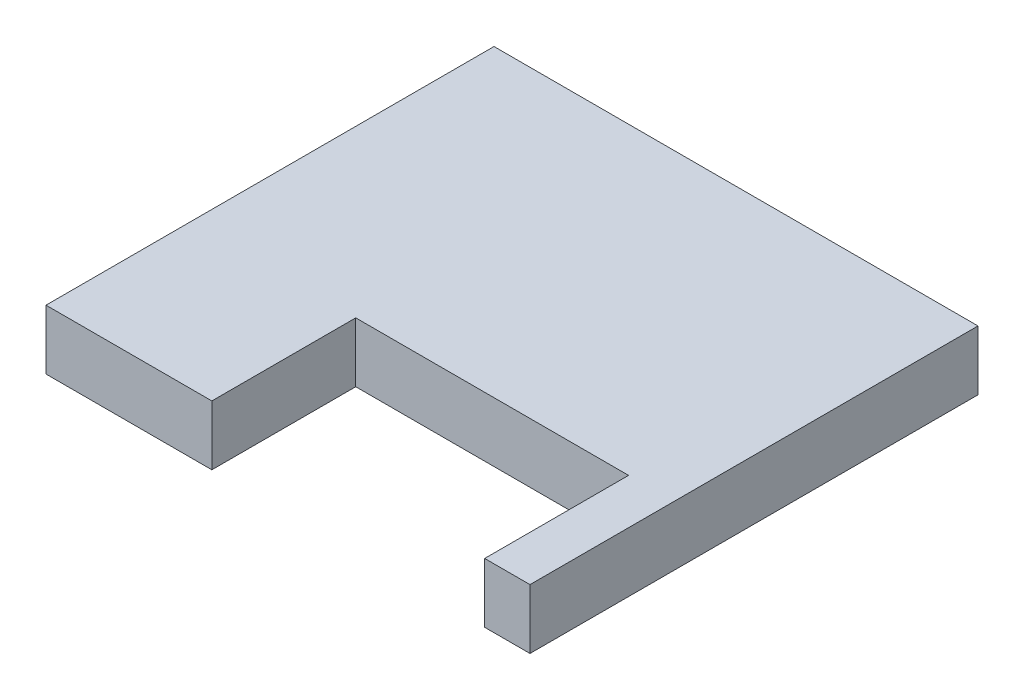
ISO-10303-21;
HEADER;
FILE_DESCRIPTION(('STEP AP214'),'2;1');
FILE_NAME('part.step','',(''),(''),'','','');
FILE_SCHEMA(('AUTOMOTIVE_DESIGN { 1 0 10303 214 1 1 1 1 }'));
ENDSEC;
DATA;
#1=APPLICATION_CONTEXT('core data for automotive mechanical design processes');
#2=APPLICATION_PROTOCOL_DEFINITION('international standard','automotive_design',2000,#1);
#3=PRODUCT_CONTEXT('',#1,'mechanical');
#4=PRODUCT('Part','Part','',(#3));
#5=PRODUCT_RELATED_PRODUCT_CATEGORY('part','',(#4));
#6=PRODUCT_DEFINITION_FORMATION('','',#4);
#7=PRODUCT_DEFINITION_CONTEXT('part definition',#1,'design');
#8=PRODUCT_DEFINITION('design','',#6,#7);
#9=PRODUCT_DEFINITION_SHAPE('','',#8);
#10=(LENGTH_UNIT() NAMED_UNIT(*) SI_UNIT(.MILLI.,.METRE.));
#11=(NAMED_UNIT(*) PLANE_ANGLE_UNIT() SI_UNIT($,.RADIAN.));
#12=(NAMED_UNIT(*) SI_UNIT($,.STERADIAN.) SOLID_ANGLE_UNIT());
#13=UNCERTAINTY_MEASURE_WITH_UNIT(LENGTH_MEASURE(1.E-05),#10,'distance_accuracy_value','');
#14=(GEOMETRIC_REPRESENTATION_CONTEXT(3) GLOBAL_UNCERTAINTY_ASSIGNED_CONTEXT((#13)) GLOBAL_UNIT_ASSIGNED_CONTEXT((#10,
#11,#12)) REPRESENTATION_CONTEXT('',''));
#15=CARTESIAN_POINT('',(0.,0.,0.));
#16=DIRECTION('',(0.,0.,1.));
#17=DIRECTION('',(1.,0.,0.));
#18=AXIS2_PLACEMENT_3D('',#15,#16,#17);
#19=CARTESIAN_POINT('',(110.307151448188,13.59916,-102.108));
#20=DIRECTION('',(0.,0.,1.));
#21=DIRECTION('',(1.,0.,0.));
#22=AXIS2_PLACEMENT_3D('',#19,#20,#21);
#23=PLANE('',#22);
#24=DIRECTION('',(-1.,0.,0.));
#25=VECTOR('',#24,1.);
#26=CARTESIAN_POINT('',(110.307151448188,0.,-102.108));
#27=LINE('',#26,#25);
#28=CARTESIAN_POINT('',(110.307151448188,0.,-102.108));
#29=VERTEX_POINT('',#28);
#30=CARTESIAN_POINT('',(0.,0.,-102.108));
#31=VERTEX_POINT('',#30);
#32=EDGE_CURVE('E129',#29,#31,#27,.T.);
#33=ORIENTED_EDGE('',*,*,#32,.T.);
#34=DIRECTION('',(0.,-1.,0.));
#35=VECTOR('',#34,1.);
#36=CARTESIAN_POINT('',(0.,13.59916,-102.108));
#37=LINE('',#36,#35);
#38=CARTESIAN_POINT('',(0.,13.59916,-102.108));
#39=VERTEX_POINT('',#38);
#40=EDGE_CURVE('E11',#39,#31,#37,.T.);
#41=ORIENTED_EDGE('',*,*,#40,.F.);
#42=DIRECTION('',(-1.,0.,0.));
#43=VECTOR('',#42,1.);
#44=CARTESIAN_POINT('',(110.307151448188,13.59916,-102.108));
#45=LINE('',#44,#43);
#46=CARTESIAN_POINT('',(110.307151448188,13.59916,-102.108));
#47=VERTEX_POINT('',#46);
#48=EDGE_CURVE('E143',#47,#39,#45,.T.);
#49=ORIENTED_EDGE('',*,*,#48,.F.);
#50=DIRECTION('',(0.,-1.,0.));
#51=VECTOR('',#50,1.);
#52=CARTESIAN_POINT('',(110.307151448188,13.59916,-102.108));
#53=LINE('',#52,#51);
#54=EDGE_CURVE('E125',#47,#29,#53,.T.);
#55=ORIENTED_EDGE('',*,*,#54,.T.);
#56=EDGE_LOOP('',(#33,#41,#49,#55));
#57=FACE_BOUND('',#56,.T.);
#58=ADVANCED_FACE('F33',(#57),#23,.F.);
#59=CARTESIAN_POINT('',(0.,13.59916,-102.108));
#60=DIRECTION('',(1.,0.,0.));
#61=DIRECTION('',(0.,0.,-1.));
#62=AXIS2_PLACEMENT_3D('',#59,#60,#61);
#63=PLANE('',#62);
#64=DIRECTION('',(0.,0.,1.));
#65=VECTOR('',#64,1.);
#66=CARTESIAN_POINT('',(0.,0.,-102.108));
#67=LINE('',#66,#65);
#68=CARTESIAN_POINT('',(0.,0.,0.));
#69=VERTEX_POINT('',#68);
#70=EDGE_CURVE('E132',#31,#69,#67,.T.);
#71=ORIENTED_EDGE('',*,*,#70,.T.);
#72=DIRECTION('',(0.,-1.,0.));
#73=VECTOR('',#72,1.);
#74=CARTESIAN_POINT('',(0.,13.59916,0.));
#75=LINE('',#74,#73);
#76=CARTESIAN_POINT('',(0.,13.59916,0.));
#77=VERTEX_POINT('',#76);
#78=EDGE_CURVE('E41',#77,#69,#75,.T.);
#79=ORIENTED_EDGE('',*,*,#78,.F.);
#80=DIRECTION('',(0.,0.,1.));
#81=VECTOR('',#80,1.);
#82=CARTESIAN_POINT('',(0.,13.59916,-102.108));
#83=LINE('',#82,#81);
#84=EDGE_CURVE('E92',#39,#77,#83,.T.);
#85=ORIENTED_EDGE('',*,*,#84,.F.);
#86=ORIENTED_EDGE('',*,*,#40,.T.);
#87=EDGE_LOOP('',(#71,#79,#85,#86));
#88=FACE_BOUND('',#87,.T.);
#89=ADVANCED_FACE('F178',(#88),#63,.F.);
#90=CARTESIAN_POINT('',(0.,13.59916,0.));
#91=DIRECTION('',(0.,0.,-1.));
#92=DIRECTION('',(-1.,0.,0.));
#93=AXIS2_PLACEMENT_3D('',#90,#91,#92);
#94=PLANE('',#93);
#95=DIRECTION('',(1.,0.,0.));
#96=VECTOR('',#95,1.);
#97=CARTESIAN_POINT('',(0.,0.,0.));
#98=LINE('',#97,#96);
#99=CARTESIAN_POINT('',(37.800765592094,0.,0.));
#100=VERTEX_POINT('',#99);
#101=EDGE_CURVE('E134',#69,#100,#98,.T.);
#102=ORIENTED_EDGE('',*,*,#101,.T.);
#103=DIRECTION('',(0.,-1.,0.));
#104=VECTOR('',#103,1.);
#105=CARTESIAN_POINT('',(37.800765592094,13.59916,0.));
#106=LINE('',#105,#104);
#107=CARTESIAN_POINT('',(37.800765592094,13.59916,0.));
#108=VERTEX_POINT('',#107);
#109=EDGE_CURVE('E150',#108,#100,#106,.T.);
#110=ORIENTED_EDGE('',*,*,#109,.F.);
#111=DIRECTION('',(1.,0.,0.));
#112=VECTOR('',#111,1.);
#113=CARTESIAN_POINT('',(0.,13.59916,0.));
#114=LINE('',#113,#112);
#115=EDGE_CURVE('E158',#77,#108,#114,.T.);
#116=ORIENTED_EDGE('',*,*,#115,.F.);
#117=ORIENTED_EDGE('',*,*,#78,.T.);
#118=EDGE_LOOP('',(#102,#110,#116,#117));
#119=FACE_BOUND('',#118,.T.);
#120=ADVANCED_FACE('F156',(#119),#94,.F.);
#121=CARTESIAN_POINT('',(37.800765592094,13.59916,0.));
#122=DIRECTION('',(-1.,0.,0.));
#123=DIRECTION('',(0.,0.,1.));
#124=AXIS2_PLACEMENT_3D('',#121,#122,#123);
#125=PLANE('',#124);
#126=DIRECTION('',(0.,0.,-1.));
#127=VECTOR('',#126,1.);
#128=CARTESIAN_POINT('',(37.800765592094,0.,0.));
#129=LINE('',#128,#127);
#130=CARTESIAN_POINT('',(37.8007655920941,0.,-32.794));
#131=VERTEX_POINT('',#130);
#132=EDGE_CURVE('E136',#100,#131,#129,.T.);
#133=ORIENTED_EDGE('',*,*,#132,.T.);
#134=DIRECTION('',(0.,-1.,0.));
#135=VECTOR('',#134,1.);
#136=CARTESIAN_POINT('',(37.8007655920941,13.59916,-32.794));
#137=LINE('',#136,#135);
#138=CARTESIAN_POINT('',(37.8007655920941,13.59916,-32.794));
#139=VERTEX_POINT('',#138);
#140=EDGE_CURVE('E147',#139,#131,#137,.T.);
#141=ORIENTED_EDGE('',*,*,#140,.F.);
#142=DIRECTION('',(0.,0.,-1.));
#143=VECTOR('',#142,1.);
#144=CARTESIAN_POINT('',(37.800765592094,13.59916,0.));
#145=LINE('',#144,#143);
#146=EDGE_CURVE('E170',#108,#139,#145,.T.);
#147=ORIENTED_EDGE('',*,*,#146,.F.);
#148=ORIENTED_EDGE('',*,*,#109,.T.);
#149=EDGE_LOOP('',(#133,#141,#147,#148));
#150=FACE_BOUND('',#149,.T.);
#151=ADVANCED_FACE('F166',(#150),#125,.F.);
#152=CARTESIAN_POINT('',(37.8007655920941,13.59916,-32.794));
#153=DIRECTION('',(0.,0.,-1.));
#154=DIRECTION('',(-1.,0.,0.));
#155=AXIS2_PLACEMENT_3D('',#152,#153,#154);
#156=PLANE('',#155);
#157=DIRECTION('',(1.,0.,0.));
#158=VECTOR('',#157,1.);
#159=CARTESIAN_POINT('',(37.8007655920941,0.,-32.794));
#160=LINE('',#159,#158);
#161=CARTESIAN_POINT('',(99.9807657240941,0.,-32.794));
#162=VERTEX_POINT('',#161);
#163=EDGE_CURVE('E138',#131,#162,#160,.T.);
#164=ORIENTED_EDGE('',*,*,#163,.T.);
#165=DIRECTION('',(0.,-1.,0.));
#166=VECTOR('',#165,1.);
#167=CARTESIAN_POINT('',(99.9807657240941,13.59916,-32.794));
#168=LINE('',#167,#166);
#169=CARTESIAN_POINT('',(99.9807657240941,13.59916,-32.794));
#170=VERTEX_POINT('',#169);
#171=EDGE_CURVE('E120',#170,#162,#168,.T.);
#172=ORIENTED_EDGE('',*,*,#171,.F.);
#173=DIRECTION('',(1.,0.,0.));
#174=VECTOR('',#173,1.);
#175=CARTESIAN_POINT('',(37.8007655920941,13.59916,-32.794));
#176=LINE('',#175,#174);
#177=EDGE_CURVE('E111',#139,#170,#176,.T.);
#178=ORIENTED_EDGE('',*,*,#177,.F.);
#179=ORIENTED_EDGE('',*,*,#140,.T.);
#180=EDGE_LOOP('',(#164,#172,#178,#179));
#181=FACE_BOUND('',#180,.T.);
#182=ADVANCED_FACE('F169',(#181),#156,.F.);
#183=CARTESIAN_POINT('',(99.9807657240941,13.59916,-32.794));
#184=DIRECTION('',(1.,0.,0.));
#185=DIRECTION('',(0.,0.,-1.));
#186=AXIS2_PLACEMENT_3D('',#183,#184,#185);
#187=PLANE('',#186);
#188=DIRECTION('',(0.,0.,1.));
#189=VECTOR('',#188,1.);
#190=CARTESIAN_POINT('',(99.9807657240941,0.,-32.794));
#191=LINE('',#190,#189);
#192=CARTESIAN_POINT('',(99.9807657240941,0.,0.));
#193=VERTEX_POINT('',#192);
#194=EDGE_CURVE('E119',#162,#193,#191,.T.);
#195=ORIENTED_EDGE('',*,*,#194,.T.);
#196=DIRECTION('',(0.,-1.,0.));
#197=VECTOR('',#196,1.);
#198=CARTESIAN_POINT('',(99.9807657240941,13.59916,0.));
#199=LINE('',#198,#197);
#200=CARTESIAN_POINT('',(99.9807657240941,13.59916,0.));
#201=VERTEX_POINT('',#200);
#202=EDGE_CURVE('E116',#201,#193,#199,.T.);
#203=ORIENTED_EDGE('',*,*,#202,.F.);
#204=DIRECTION('',(0.,0.,1.));
#205=VECTOR('',#204,1.);
#206=CARTESIAN_POINT('',(99.9807657240941,13.59916,-32.794));
#207=LINE('',#206,#205);
#208=EDGE_CURVE('E105',#170,#201,#207,.T.);
#209=ORIENTED_EDGE('',*,*,#208,.F.);
#210=ORIENTED_EDGE('',*,*,#171,.T.);
#211=EDGE_LOOP('',(#195,#203,#209,#210));
#212=FACE_BOUND('',#211,.T.);
#213=ADVANCED_FACE('F117',(#212),#187,.F.);
#214=CARTESIAN_POINT('',(99.9807657240941,13.59916,0.));
#215=DIRECTION('',(0.,0.,-1.));
#216=DIRECTION('',(-1.,0.,0.));
#217=AXIS2_PLACEMENT_3D('',#214,#215,#216);
#218=PLANE('',#217);
#219=DIRECTION('',(1.,0.,0.));
#220=VECTOR('',#219,1.);
#221=CARTESIAN_POINT('',(99.9807657240941,0.,0.));
#222=LINE('',#221,#220);
#223=CARTESIAN_POINT('',(110.307151448188,0.,0.));
#224=VERTEX_POINT('',#223);
#225=EDGE_CURVE('E78',#193,#224,#222,.T.);
#226=ORIENTED_EDGE('',*,*,#225,.T.);
#227=DIRECTION('',(0.,-1.,0.));
#228=VECTOR('',#227,1.);
#229=CARTESIAN_POINT('',(110.307151448188,13.59916,0.));
#230=LINE('',#229,#228);
#231=CARTESIAN_POINT('',(110.307151448188,13.59916,0.));
#232=VERTEX_POINT('',#231);
#233=EDGE_CURVE('E121',#232,#224,#230,.T.);
#234=ORIENTED_EDGE('',*,*,#233,.F.);
#235=DIRECTION('',(1.,0.,0.));
#236=VECTOR('',#235,1.);
#237=CARTESIAN_POINT('',(99.9807657240941,13.59916,0.));
#238=LINE('',#237,#236);
#239=EDGE_CURVE('E109',#201,#232,#238,.T.);
#240=ORIENTED_EDGE('',*,*,#239,.F.);
#241=ORIENTED_EDGE('',*,*,#202,.T.);
#242=EDGE_LOOP('',(#226,#234,#240,#241));
#243=FACE_BOUND('',#242,.T.);
#244=ADVANCED_FACE('F123',(#243),#218,.F.);
#245=CARTESIAN_POINT('',(110.307151448188,13.59916,0.));
#246=DIRECTION('',(-1.,0.,0.));
#247=DIRECTION('',(0.,0.,1.));
#248=AXIS2_PLACEMENT_3D('',#245,#246,#247);
#249=PLANE('',#248);
#250=DIRECTION('',(0.,0.,-1.));
#251=VECTOR('',#250,1.);
#252=CARTESIAN_POINT('',(110.307151448188,0.,0.));
#253=LINE('',#252,#251);
#254=EDGE_CURVE('E84',#224,#29,#253,.T.);
#255=ORIENTED_EDGE('',*,*,#254,.T.);
#256=ORIENTED_EDGE('',*,*,#54,.F.);
#257=DIRECTION('',(0.,0.,-1.));
#258=VECTOR('',#257,1.);
#259=CARTESIAN_POINT('',(110.307151448188,13.59916,0.));
#260=LINE('',#259,#258);
#261=EDGE_CURVE('E49',#232,#47,#260,.T.);
#262=ORIENTED_EDGE('',*,*,#261,.F.);
#263=ORIENTED_EDGE('',*,*,#233,.T.);
#264=EDGE_LOOP('',(#255,#256,#262,#263));
#265=FACE_BOUND('',#264,.T.);
#266=ADVANCED_FACE('F194',(#265),#249,.F.);
#267=CARTESIAN_POINT('',(0.,13.59916,0.));
#268=DIRECTION('',(0.,1.,0.));
#269=DIRECTION('',(0.,0.,1.));
#270=AXIS2_PLACEMENT_3D('',#267,#268,#269);
#271=PLANE('',#270);
#272=ORIENTED_EDGE('',*,*,#48,.T.);
#273=ORIENTED_EDGE('',*,*,#84,.T.);
#274=ORIENTED_EDGE('',*,*,#115,.T.);
#275=ORIENTED_EDGE('',*,*,#146,.T.);
#276=ORIENTED_EDGE('',*,*,#177,.T.);
#277=ORIENTED_EDGE('',*,*,#208,.T.);
#278=ORIENTED_EDGE('',*,*,#239,.T.);
#279=ORIENTED_EDGE('',*,*,#261,.T.);
#280=EDGE_LOOP('',(#272,#273,#274,#275,#276,#277,#278,#279));
#281=FACE_BOUND('',#280,.T.);
#282=ADVANCED_FACE('F107',(#281),#271,.T.);
#283=CARTESIAN_POINT('',(0.,0.,0.));
#284=DIRECTION('',(0.,1.,0.));
#285=DIRECTION('',(0.,0.,1.));
#286=AXIS2_PLACEMENT_3D('',#283,#284,#285);
#287=PLANE('',#286);
#288=ORIENTED_EDGE('',*,*,#32,.F.);
#289=ORIENTED_EDGE('',*,*,#254,.F.);
#290=ORIENTED_EDGE('',*,*,#225,.F.);
#291=ORIENTED_EDGE('',*,*,#194,.F.);
#292=ORIENTED_EDGE('',*,*,#163,.F.);
#293=ORIENTED_EDGE('',*,*,#132,.F.);
#294=ORIENTED_EDGE('',*,*,#101,.F.);
#295=ORIENTED_EDGE('',*,*,#70,.F.);
#296=EDGE_LOOP('',(#288,#289,#290,#291,#292,#293,#294,#295));
#297=FACE_BOUND('',#296,.T.);
#298=ADVANCED_FACE('F162',(#297),#287,.F.);
#299=CLOSED_SHELL('',(#58,#89,#120,#151,#182,#213,#244,#266,#282,#298));
#300=MANIFOLD_SOLID_BREP('B2',#299);
#301=ADVANCED_BREP_SHAPE_REPRESENTATION('',(#18,#300),#14);
#302=SHAPE_DEFINITION_REPRESENTATION(#9,#301);
ENDSEC;
END-ISO-10303-21;
